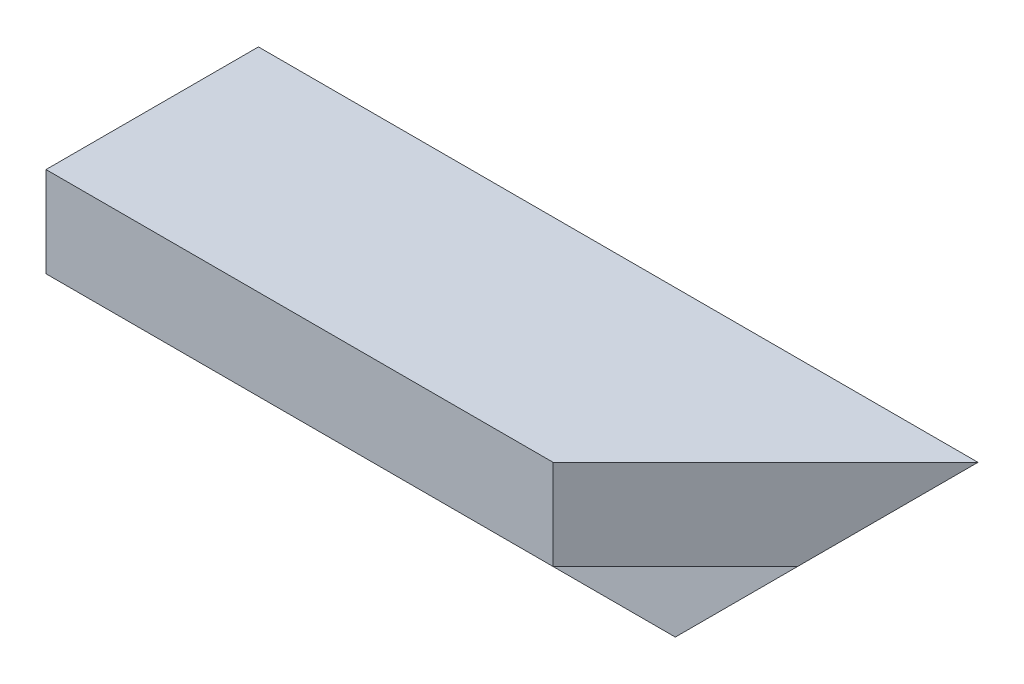
ISO-10303-21;
HEADER;
FILE_DESCRIPTION(('STEP AP214'),'2;1');
FILE_NAME('part.step','',(''),(''),'','','');
FILE_SCHEMA(('AUTOMOTIVE_DESIGN { 1 0 10303 214 1 1 1 1 }'));
ENDSEC;
DATA;
#1=APPLICATION_CONTEXT('core data for automotive mechanical design processes');
#2=APPLICATION_PROTOCOL_DEFINITION('international standard','automotive_design',2000,#1);
#3=PRODUCT_CONTEXT('',#1,'mechanical');
#4=PRODUCT('Part','Part','',(#3));
#5=PRODUCT_RELATED_PRODUCT_CATEGORY('part','',(#4));
#6=PRODUCT_DEFINITION_FORMATION('','',#4);
#7=PRODUCT_DEFINITION_CONTEXT('part definition',#1,'design');
#8=PRODUCT_DEFINITION('design','',#6,#7);
#9=PRODUCT_DEFINITION_SHAPE('','',#8);
#10=(LENGTH_UNIT() NAMED_UNIT(*) SI_UNIT(.MILLI.,.METRE.));
#11=(NAMED_UNIT(*) PLANE_ANGLE_UNIT() SI_UNIT($,.RADIAN.));
#12=(NAMED_UNIT(*) SI_UNIT($,.STERADIAN.) SOLID_ANGLE_UNIT());
#13=UNCERTAINTY_MEASURE_WITH_UNIT(LENGTH_MEASURE(1.E-05),#10,'distance_accuracy_value','');
#14=(GEOMETRIC_REPRESENTATION_CONTEXT(3) GLOBAL_UNCERTAINTY_ASSIGNED_CONTEXT((#13)) GLOBAL_UNIT_ASSIGNED_CONTEXT((#10,
#11,#12)) REPRESENTATION_CONTEXT('',''));
#15=CARTESIAN_POINT('',(0.,0.,0.));
#16=DIRECTION('',(0.,0.,1.));
#17=DIRECTION('',(1.,0.,0.));
#18=AXIS2_PLACEMENT_3D('',#15,#16,#17);
#19=CARTESIAN_POINT('',(222.,-40.,0.));
#20=DIRECTION('',(0.,0.,1.));
#21=DIRECTION('',(1.,0.,0.));
#22=AXIS2_PLACEMENT_3D('',#19,#20,#21);
#23=PLANE('',#22);
#24=DIRECTION('',(-1.,0.,0.));
#25=VECTOR('',#24,1.);
#26=CARTESIAN_POINT('',(222.,0.,0.));
#27=LINE('',#26,#25);
#28=CARTESIAN_POINT('',(222.,0.,0.));
#29=VERTEX_POINT('',#28);
#30=CARTESIAN_POINT('',(86.499999999961,0.,0.));
#31=VERTEX_POINT('',#30);
#32=EDGE_CURVE('E40',#29,#31,#27,.T.);
#33=ORIENTED_EDGE('',*,*,#32,.F.);
#34=DIRECTION('',(0.707106781186548,0.707106781186547,0.));
#35=VECTOR('',#34,1.);
#36=CARTESIAN_POINT('',(222.,0.,0.));
#37=LINE('',#36,#35);
#38=CARTESIAN_POINT('',(182.,-40.,0.));
#39=VERTEX_POINT('',#38);
#40=EDGE_CURVE('E88',#39,#29,#37,.T.);
#41=ORIENTED_EDGE('',*,*,#40,.F.);
#42=DIRECTION('',(-1.,0.,0.));
#43=VECTOR('',#42,1.);
#44=CARTESIAN_POINT('',(222.,-40.,0.));
#45=LINE('',#44,#43);
#46=CARTESIAN_POINT('',(86.499999999961,-40.,0.));
#47=VERTEX_POINT('',#46);
#48=EDGE_CURVE('E47',#39,#47,#45,.T.);
#49=ORIENTED_EDGE('',*,*,#48,.T.);
#50=DIRECTION('',(0.,1.,0.));
#51=VECTOR('',#50,1.);
#52=CARTESIAN_POINT('',(86.499999999961,-40.,0.));
#53=LINE('',#52,#51);
#54=EDGE_CURVE('E118',#47,#31,#53,.T.);
#55=ORIENTED_EDGE('',*,*,#54,.T.);
#56=EDGE_LOOP('',(#33,#41,#49,#55));
#57=FACE_BOUND('',#56,.T.);
#58=ADVANCED_FACE('F33',(#57),#23,.F.);
#59=CARTESIAN_POINT('',(222.,0.,0.));
#60=DIRECTION('',(0.,-1.,0.));
#61=DIRECTION('',(0.,0.,-1.));
#62=AXIS2_PLACEMENT_3D('',#59,#60,#61);
#63=PLANE('',#62);
#64=DIRECTION('',(-1.,0.,0.));
#65=VECTOR('',#64,1.);
#66=CARTESIAN_POINT('',(222.,0.,40.));
#67=LINE('',#66,#65);
#68=CARTESIAN_POINT('',(182.,0.,40.));
#69=VERTEX_POINT('',#68);
#70=CARTESIAN_POINT('',(86.499999999961,0.,40.));
#71=VERTEX_POINT('',#70);
#72=EDGE_CURVE('E109',#69,#71,#67,.T.);
#73=ORIENTED_EDGE('',*,*,#72,.F.);
#74=DIRECTION('',(-0.707106781186548,0.,0.707106781186547));
#75=VECTOR('',#74,1.);
#76=CARTESIAN_POINT('',(222.,0.,0.));
#77=LINE('',#76,#75);
#78=EDGE_CURVE('E117',#29,#69,#77,.T.);
#79=ORIENTED_EDGE('',*,*,#78,.F.);
#80=ORIENTED_EDGE('',*,*,#32,.T.);
#81=DIRECTION('',(0.,0.,1.));
#82=VECTOR('',#81,1.);
#83=CARTESIAN_POINT('',(86.499999999961,0.,0.));
#84=LINE('',#83,#82);
#85=EDGE_CURVE('E115',#31,#71,#84,.T.);
#86=ORIENTED_EDGE('',*,*,#85,.T.);
#87=EDGE_LOOP('',(#73,#79,#80,#86));
#88=FACE_BOUND('',#87,.T.);
#89=ADVANCED_FACE('F114',(#88),#63,.F.);
#90=CARTESIAN_POINT('',(222.,0.,40.));
#91=DIRECTION('',(0.,0.,-1.));
#92=DIRECTION('',(-1.,0.,0.));
#93=AXIS2_PLACEMENT_3D('',#90,#91,#92);
#94=PLANE('',#93);
#95=DIRECTION('',(-1.,0.,0.));
#96=VECTOR('',#95,1.);
#97=CARTESIAN_POINT('',(222.,-17.,40.));
#98=LINE('',#97,#96);
#99=CARTESIAN_POINT('',(182.,-17.,40.));
#100=VERTEX_POINT('',#99);
#101=CARTESIAN_POINT('',(86.499999999961,-17.,40.));
#102=VERTEX_POINT('',#101);
#103=EDGE_CURVE('E107',#100,#102,#98,.T.);
#104=ORIENTED_EDGE('',*,*,#103,.F.);
#105=DIRECTION('',(0.,1.,0.));
#106=VECTOR('',#105,1.);
#107=CARTESIAN_POINT('',(182.,-40.,40.));
#108=LINE('',#107,#106);
#109=EDGE_CURVE('E125',#100,#69,#108,.T.);
#110=ORIENTED_EDGE('',*,*,#109,.T.);
#111=ORIENTED_EDGE('',*,*,#72,.T.);
#112=DIRECTION('',(0.,-1.,0.));
#113=VECTOR('',#112,1.);
#114=CARTESIAN_POINT('',(86.499999999961,0.,40.));
#115=LINE('',#114,#113);
#116=EDGE_CURVE('E122',#71,#102,#115,.T.);
#117=ORIENTED_EDGE('',*,*,#116,.T.);
#118=EDGE_LOOP('',(#104,#110,#111,#117));
#119=FACE_BOUND('',#118,.T.);
#120=ADVANCED_FACE('F153',(#119),#94,.F.);
#121=CARTESIAN_POINT('',(222.,-17.,40.));
#122=DIRECTION('',(0.,1.,0.));
#123=DIRECTION('',(0.,0.,1.));
#124=AXIS2_PLACEMENT_3D('',#121,#122,#123);
#125=PLANE('',#124);
#126=DIRECTION('',(-1.,0.,0.));
#127=VECTOR('',#126,1.);
#128=CARTESIAN_POINT('',(222.,-17.,17.));
#129=LINE('',#128,#127);
#130=CARTESIAN_POINT('',(205.,-17.,17.));
#131=VERTEX_POINT('',#130);
#132=CARTESIAN_POINT('',(86.499999999961,-17.,17.));
#133=VERTEX_POINT('',#132);
#134=EDGE_CURVE('E100',#131,#133,#129,.T.);
#135=ORIENTED_EDGE('',*,*,#134,.F.);
#136=DIRECTION('',(-0.707106781186548,0.,0.707106781186548));
#137=VECTOR('',#136,1.);
#138=CARTESIAN_POINT('',(202.,-17.,20.));
#139=LINE('',#138,#137);
#140=EDGE_CURVE('E120',#131,#100,#139,.T.);
#141=ORIENTED_EDGE('',*,*,#140,.T.);
#142=ORIENTED_EDGE('',*,*,#103,.T.);
#143=DIRECTION('',(0.,0.,-1.));
#144=VECTOR('',#143,1.);
#145=CARTESIAN_POINT('',(86.499999999961,-17.,40.));
#146=LINE('',#145,#144);
#147=EDGE_CURVE('E131',#102,#133,#146,.T.);
#148=ORIENTED_EDGE('',*,*,#147,.T.);
#149=EDGE_LOOP('',(#135,#141,#142,#148));
#150=FACE_BOUND('',#149,.T.);
#151=ADVANCED_FACE('F157',(#150),#125,.F.);
#152=CARTESIAN_POINT('',(222.,-17.,17.));
#153=DIRECTION('',(0.,0.,-1.));
#154=DIRECTION('',(0.,1.,0.));
#155=AXIS2_PLACEMENT_3D('',#152,#153,#154);
#156=PLANE('',#155);
#157=DIRECTION('',(-1.,0.,0.));
#158=VECTOR('',#157,1.);
#159=CARTESIAN_POINT('',(222.,-40.,17.));
#160=LINE('',#159,#158);
#161=CARTESIAN_POINT('',(182.,-40.,17.));
#162=VERTEX_POINT('',#161);
#163=CARTESIAN_POINT('',(86.499999999961,-40.,17.));
#164=VERTEX_POINT('',#163);
#165=EDGE_CURVE('E54',#162,#164,#160,.T.);
#166=ORIENTED_EDGE('',*,*,#165,.F.);
#167=DIRECTION('',(0.707106781186548,0.707106781186547,0.));
#168=VECTOR('',#167,1.);
#169=CARTESIAN_POINT('',(213.5,-8.5,17.));
#170=LINE('',#169,#168);
#171=EDGE_CURVE('E90',#162,#131,#170,.T.);
#172=ORIENTED_EDGE('',*,*,#171,.T.);
#173=ORIENTED_EDGE('',*,*,#134,.T.);
#174=DIRECTION('',(0.,-1.,0.));
#175=VECTOR('',#174,1.);
#176=CARTESIAN_POINT('',(86.499999999961,-17.,17.));
#177=LINE('',#176,#175);
#178=EDGE_CURVE('E102',#133,#164,#177,.T.);
#179=ORIENTED_EDGE('',*,*,#178,.T.);
#180=EDGE_LOOP('',(#166,#172,#173,#179));
#181=FACE_BOUND('',#180,.T.);
#182=ADVANCED_FACE('F135',(#181),#156,.F.);
#183=CARTESIAN_POINT('',(222.,-40.,17.));
#184=DIRECTION('',(0.,1.,0.));
#185=DIRECTION('',(0.,0.,1.));
#186=AXIS2_PLACEMENT_3D('',#183,#184,#185);
#187=PLANE('',#186);
#188=ORIENTED_EDGE('',*,*,#48,.F.);
#189=DIRECTION('',(0.,0.,-1.));
#190=VECTOR('',#189,1.);
#191=CARTESIAN_POINT('',(182.,-40.,40.));
#192=LINE('',#191,#190);
#193=EDGE_CURVE('E86',#162,#39,#192,.T.);
#194=ORIENTED_EDGE('',*,*,#193,.F.);
#195=ORIENTED_EDGE('',*,*,#165,.T.);
#196=DIRECTION('',(0.,0.,-1.));
#197=VECTOR('',#196,1.);
#198=CARTESIAN_POINT('',(86.499999999961,-40.,17.));
#199=LINE('',#198,#197);
#200=EDGE_CURVE('E97',#164,#47,#199,.T.);
#201=ORIENTED_EDGE('',*,*,#200,.T.);
#202=EDGE_LOOP('',(#188,#194,#195,#201));
#203=FACE_BOUND('',#202,.T.);
#204=ADVANCED_FACE('F95',(#203),#187,.F.);
#205=CARTESIAN_POINT('',(86.499999999961,0.,0.));
#206=DIRECTION('',(1.,0.,0.));
#207=DIRECTION('',(0.,0.,-1.));
#208=AXIS2_PLACEMENT_3D('',#205,#206,#207);
#209=PLANE('',#208);
#210=ORIENTED_EDGE('',*,*,#54,.F.);
#211=ORIENTED_EDGE('',*,*,#200,.F.);
#212=ORIENTED_EDGE('',*,*,#178,.F.);
#213=ORIENTED_EDGE('',*,*,#147,.F.);
#214=ORIENTED_EDGE('',*,*,#116,.F.);
#215=ORIENTED_EDGE('',*,*,#85,.F.);
#216=EDGE_LOOP('',(#210,#211,#212,#213,#214,#215));
#217=FACE_BOUND('',#216,.T.);
#218=ADVANCED_FACE('F138',(#217),#209,.F.);
#219=CARTESIAN_POINT('',(222.,-40.,0.));
#220=DIRECTION('',(-0.707106781186548,0.,-0.707106781186548));
#221=DIRECTION('',(-0.707106781186548,0.,0.707106781186548));
#222=AXIS2_PLACEMENT_3D('',#219,#220,#221);
#223=PLANE('',#222);
#224=ORIENTED_EDGE('',*,*,#140,.F.);
#225=DIRECTION('',(0.577350269189626,0.577350269189626,-0.577350269189626));
#226=VECTOR('',#225,1.);
#227=CARTESIAN_POINT('',(208.666666666667,-13.3333333333333,13.3333333333333));
#228=LINE('',#227,#226);
#229=EDGE_CURVE('E11',#131,#29,#228,.T.);
#230=ORIENTED_EDGE('',*,*,#229,.T.);
#231=ORIENTED_EDGE('',*,*,#78,.T.);
#232=ORIENTED_EDGE('',*,*,#109,.F.);
#233=EDGE_LOOP('',(#224,#230,#231,#232));
#234=FACE_BOUND('',#233,.T.);
#235=ADVANCED_FACE('F140',(#234),#223,.F.);
#236=CARTESIAN_POINT('',(222.,0.,40.));
#237=DIRECTION('',(-0.707106781186547,0.707106781186548,0.));
#238=DIRECTION('',(-0.707106781186548,-0.707106781186547,0.));
#239=AXIS2_PLACEMENT_3D('',#236,#237,#238);
#240=PLANE('',#239);
#241=ORIENTED_EDGE('',*,*,#193,.T.);
#242=ORIENTED_EDGE('',*,*,#40,.T.);
#243=ORIENTED_EDGE('',*,*,#229,.F.);
#244=ORIENTED_EDGE('',*,*,#171,.F.);
#245=EDGE_LOOP('',(#241,#242,#243,#244));
#246=FACE_BOUND('',#245,.T.);
#247=ADVANCED_FACE('F87',(#246),#240,.F.);
#248=CLOSED_SHELL('',(#58,#89,#120,#151,#182,#204,#218,#235,#247));
#249=MANIFOLD_SOLID_BREP('B2',#248);
#250=ADVANCED_BREP_SHAPE_REPRESENTATION('',(#18,#249),#14);
#251=SHAPE_DEFINITION_REPRESENTATION(#9,#250);
ENDSEC;
END-ISO-10303-21;
